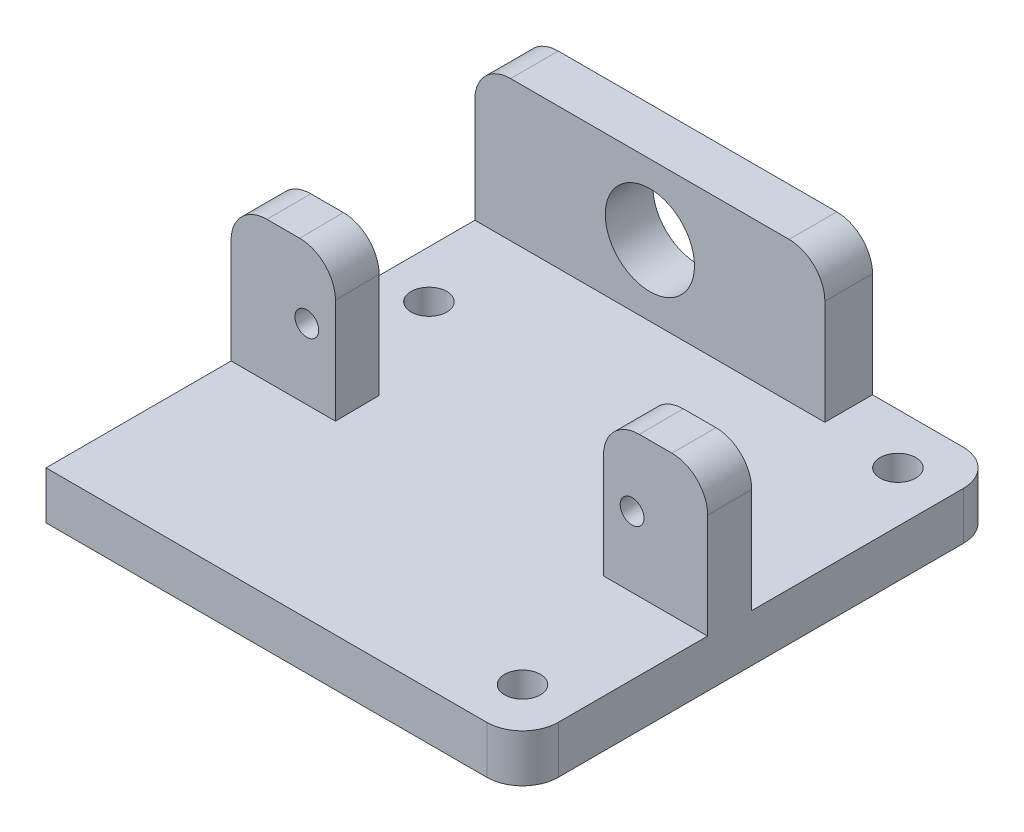
ISO-10303-21;
HEADER;
FILE_DESCRIPTION(('STEP AP214'),'2;1');
FILE_NAME('part.step','',(''),(''),'','','');
FILE_SCHEMA(('AUTOMOTIVE_DESIGN { 1 0 10303 214 1 1 1 1 }'));
ENDSEC;
DATA;
#1=APPLICATION_CONTEXT('core data for automotive mechanical design processes');
#2=APPLICATION_PROTOCOL_DEFINITION('international standard','automotive_design',2000,#1);
#3=PRODUCT_CONTEXT('',#1,'mechanical');
#4=PRODUCT('Part','Part','',(#3));
#5=PRODUCT_RELATED_PRODUCT_CATEGORY('part','',(#4));
#6=PRODUCT_DEFINITION_FORMATION('','',#4);
#7=PRODUCT_DEFINITION_CONTEXT('part definition',#1,'design');
#8=PRODUCT_DEFINITION('design','',#6,#7);
#9=PRODUCT_DEFINITION_SHAPE('','',#8);
#10=(LENGTH_UNIT() NAMED_UNIT(*) SI_UNIT(.MILLI.,.METRE.));
#11=(NAMED_UNIT(*) PLANE_ANGLE_UNIT() SI_UNIT($,.RADIAN.));
#12=(NAMED_UNIT(*) SI_UNIT($,.STERADIAN.) SOLID_ANGLE_UNIT());
#13=UNCERTAINTY_MEASURE_WITH_UNIT(LENGTH_MEASURE(1.E-05),#10,'distance_accuracy_value','');
#14=(GEOMETRIC_REPRESENTATION_CONTEXT(3) GLOBAL_UNCERTAINTY_ASSIGNED_CONTEXT((#13)) GLOBAL_UNIT_ASSIGNED_CONTEXT((#10,
#11,#12)) REPRESENTATION_CONTEXT('',''));
#15=CARTESIAN_POINT('',(0.,0.,0.));
#16=DIRECTION('',(0.,0.,1.));
#17=DIRECTION('',(1.,0.,0.));
#18=AXIS2_PLACEMENT_3D('',#15,#16,#17);
#19=CARTESIAN_POINT('',(0.,4.,0.));
#20=DIRECTION('',(0.,-1.,0.));
#21=DIRECTION('',(0.,0.,-1.));
#22=AXIS2_PLACEMENT_3D('',#19,#20,#21);
#23=PLANE('',#22);
#24=CARTESIAN_POINT('',(15.7573593128807,4.,-15.7573593128807));
#25=DIRECTION('',(0.,1.,0.));
#26=DIRECTION('',(0.,0.,1.));
#27=AXIS2_PLACEMENT_3D('',#24,#25,#26);
#28=CIRCLE('',#27,1.5);
#29=CARTESIAN_POINT('',(15.7573593128807,4.,-14.2573593128807));
#30=VERTEX_POINT('',#29);
#31=EDGE_CURVE('E418',#30,#30,#28,.T.);
#32=ORIENTED_EDGE('',*,*,#31,.F.);
#33=EDGE_LOOP('',(#32));
#34=FACE_BOUND('',#33,.T.);
#35=CARTESIAN_POINT('',(15.7573593128807,4.,15.7573593128807));
#36=DIRECTION('',(0.,1.,0.));
#37=DIRECTION('',(0.,0.,1.));
#38=AXIS2_PLACEMENT_3D('',#35,#36,#37);
#39=CIRCLE('',#38,1.5);
#40=CARTESIAN_POINT('',(15.7573593128807,4.,17.2573593128807));
#41=VERTEX_POINT('',#40);
#42=EDGE_CURVE('E424',#41,#41,#39,.T.);
#43=ORIENTED_EDGE('',*,*,#42,.F.);
#44=EDGE_LOOP('',(#43));
#45=FACE_BOUND('',#44,.T.);
#46=CARTESIAN_POINT('',(-16.,4.,-8.14578966185309));
#47=DIRECTION('',(0.,1.,0.));
#48=DIRECTION('',(0.,0.,1.));
#49=AXIS2_PLACEMENT_3D('',#46,#47,#48);
#50=CIRCLE('',#49,1.5);
#51=CARTESIAN_POINT('',(-16.,4.,-6.64578966185308));
#52=VERTEX_POINT('',#51);
#53=EDGE_CURVE('E415',#52,#52,#50,.T.);
#54=ORIENTED_EDGE('',*,*,#53,.F.);
#55=EDGE_LOOP('',(#54));
#56=FACE_BOUND('',#55,.T.);
#57=DIRECTION('',(0.,0.,-1.));
#58=VECTOR('',#57,1.);
#59=CARTESIAN_POINT('',(20.,4.,20.));
#60=LINE('',#59,#58);
#61=CARTESIAN_POINT('',(20.,4.,0.761716698699549));
#62=VERTEX_POINT('',#61);
#63=CARTESIAN_POINT('',(20.,4.,-17.));
#64=VERTEX_POINT('',#63);
#65=EDGE_CURVE('E280',#62,#64,#60,.T.);
#66=ORIENTED_EDGE('',*,*,#65,.T.);
#67=CARTESIAN_POINT('',(17.,4.,-17.));
#68=DIRECTION('',(0.,-1.,0.));
#69=DIRECTION('',(0.,0.,-1.));
#70=AXIS2_PLACEMENT_3D('',#67,#68,#69);
#71=CIRCLE('',#70,3.);
#72=CARTESIAN_POINT('',(17.,4.,-20.));
#73=VERTEX_POINT('',#72);
#74=EDGE_CURVE('E43',#64,#73,#71,.F.);
#75=ORIENTED_EDGE('',*,*,#74,.T.);
#76=DIRECTION('',(-1.,0.,0.));
#77=VECTOR('',#76,1.);
#78=CARTESIAN_POINT('',(-20.,4.,-20.));
#79=LINE('',#78,#77);
#80=CARTESIAN_POINT('',(9.38,4.,-20.));
#81=VERTEX_POINT('',#80);
#82=EDGE_CURVE('E279',#73,#81,#79,.T.);
#83=ORIENTED_EDGE('',*,*,#82,.T.);
#84=DIRECTION('',(0.,0.,-1.));
#85=VECTOR('',#84,1.);
#86=CARTESIAN_POINT('',(9.38,4.,-16.));
#87=LINE('',#86,#85);
#88=CARTESIAN_POINT('',(9.38,4.,-16.));
#89=VERTEX_POINT('',#88);
#90=EDGE_CURVE('E218',#89,#81,#87,.T.);
#91=ORIENTED_EDGE('',*,*,#90,.F.);
#92=DIRECTION('',(1.,0.,0.));
#93=VECTOR('',#92,1.);
#94=CARTESIAN_POINT('',(9.38,4.,-16.));
#95=LINE('',#94,#93);
#96=CARTESIAN_POINT('',(-20.,4.,-16.));
#97=VERTEX_POINT('',#96);
#98=EDGE_CURVE('E197',#97,#89,#95,.T.);
#99=ORIENTED_EDGE('',*,*,#98,.F.);
#100=DIRECTION('',(0.,0.,1.));
#101=VECTOR('',#100,1.);
#102=CARTESIAN_POINT('',(-20.,4.,20.));
#103=LINE('',#102,#101);
#104=CARTESIAN_POINT('',(-20.,4.,0.761716698699547));
#105=VERTEX_POINT('',#104);
#106=EDGE_CURVE('E206',#97,#105,#103,.T.);
#107=ORIENTED_EDGE('',*,*,#106,.T.);
#108=DIRECTION('',(-1.,0.,0.));
#109=VECTOR('',#108,1.);
#110=CARTESIAN_POINT('',(-20.,4.,0.761716698699547));
#111=LINE('',#110,#109);
#112=CARTESIAN_POINT('',(-11.2760695865092,4.,0.761716698699547));
#113=VERTEX_POINT('',#112);
#114=EDGE_CURVE('E266',#113,#105,#111,.T.);
#115=ORIENTED_EDGE('',*,*,#114,.F.);
#116=DIRECTION('',(-0.00844114842498578,0.,-0.999964372871988));
#117=VECTOR('',#116,1.);
#118=CARTESIAN_POINT('',(-11.2760695865092,4.,0.761716698699547));
#119=LINE('',#118,#117);
#120=CARTESIAN_POINT('',(-11.2448362245817,4.,4.46171669869955));
#121=VERTEX_POINT('',#120);
#122=EDGE_CURVE('E255',#121,#113,#119,.T.);
#123=ORIENTED_EDGE('',*,*,#122,.F.);
#124=DIRECTION('',(1.,0.,0.));
#125=VECTOR('',#124,1.);
#126=CARTESIAN_POINT('',(-20.,4.,4.46171669869955));
#127=LINE('',#126,#125);
#128=CARTESIAN_POINT('',(-20.,4.,4.46171669869955));
#129=VERTEX_POINT('',#128);
#130=EDGE_CURVE('E260',#129,#121,#127,.T.);
#131=ORIENTED_EDGE('',*,*,#130,.F.);
#132=CARTESIAN_POINT('',(-20.,4.,20.));
#133=VERTEX_POINT('',#132);
#134=EDGE_CURVE('E214',#129,#133,#103,.T.);
#135=ORIENTED_EDGE('',*,*,#134,.T.);
#136=DIRECTION('',(1.,0.,0.));
#137=VECTOR('',#136,1.);
#138=CARTESIAN_POINT('',(-20.,4.,20.));
#139=LINE('',#138,#137);
#140=CARTESIAN_POINT('',(17.,4.,20.));
#141=VERTEX_POINT('',#140);
#142=EDGE_CURVE('E213',#133,#141,#139,.T.);
#143=ORIENTED_EDGE('',*,*,#142,.T.);
#144=CARTESIAN_POINT('',(17.,4.,17.));
#145=DIRECTION('',(0.,-1.,0.));
#146=DIRECTION('',(0.,0.,-1.));
#147=AXIS2_PLACEMENT_3D('',#144,#145,#146);
#148=CIRCLE('',#147,3.);
#149=CARTESIAN_POINT('',(20.,4.,17.));
#150=VERTEX_POINT('',#149);
#151=EDGE_CURVE('E360',#141,#150,#148,.F.);
#152=ORIENTED_EDGE('',*,*,#151,.T.);
#153=CARTESIAN_POINT('',(20.,4.,4.46171669869955));
#154=VERTEX_POINT('',#153);
#155=EDGE_CURVE('E277',#150,#154,#60,.T.);
#156=ORIENTED_EDGE('',*,*,#155,.T.);
#157=DIRECTION('',(1.,0.,0.));
#158=VECTOR('',#157,1.);
#159=CARTESIAN_POINT('',(11.2604529055455,4.,4.46171669869955));
#160=LINE('',#159,#158);
#161=CARTESIAN_POINT('',(11.2604529055455,4.,4.46171669869955));
#162=VERTEX_POINT('',#161);
#163=EDGE_CURVE('E236',#162,#154,#160,.T.);
#164=ORIENTED_EDGE('',*,*,#163,.F.);
#165=DIRECTION('',(0.,0.,1.));
#166=VECTOR('',#165,1.);
#167=CARTESIAN_POINT('',(11.2604529055455,4.,0.761716698699549));
#168=LINE('',#167,#166);
#169=CARTESIAN_POINT('',(11.2604529055455,4.,0.761716698699549));
#170=VERTEX_POINT('',#169);
#171=EDGE_CURVE('E242',#170,#162,#168,.T.);
#172=ORIENTED_EDGE('',*,*,#171,.F.);
#173=DIRECTION('',(-1.,0.,0.));
#174=VECTOR('',#173,1.);
#175=CARTESIAN_POINT('',(11.2604529055455,4.,0.761716698699549));
#176=LINE('',#175,#174);
#177=EDGE_CURVE('E231',#62,#170,#176,.T.);
#178=ORIENTED_EDGE('',*,*,#177,.F.);
#179=EDGE_LOOP('',(#66,#75,#83,#91,#99,#107,#115,#123,#131,#135,#143,#152,#156,#164,#172,#178));
#180=FACE_BOUND('',#179,.T.);
#181=ADVANCED_FACE('F35',(#34,#45,#56,#180),#23,.F.);
#182=CARTESIAN_POINT('',(20.,4.,20.));
#183=DIRECTION('',(-1.,0.,0.));
#184=DIRECTION('',(0.,0.,1.));
#185=AXIS2_PLACEMENT_3D('',#182,#183,#184);
#186=PLANE('',#185);
#187=DIRECTION('',(0.,0.,-1.));
#188=VECTOR('',#187,1.);
#189=CARTESIAN_POINT('',(20.,0.,20.));
#190=LINE('',#189,#188);
#191=CARTESIAN_POINT('',(20.,0.,17.));
#192=VERTEX_POINT('',#191);
#193=CARTESIAN_POINT('',(20.,0.,-17.));
#194=VERTEX_POINT('',#193);
#195=EDGE_CURVE('E276',#192,#194,#190,.T.);
#196=ORIENTED_EDGE('',*,*,#195,.T.);
#197=DIRECTION('',(0.,-1.,0.));
#198=VECTOR('',#197,1.);
#199=CARTESIAN_POINT('',(20.,4.,-17.));
#200=LINE('',#199,#198);
#201=EDGE_CURVE('E56',#194,#64,#200,.F.);
#202=ORIENTED_EDGE('',*,*,#201,.T.);
#203=ORIENTED_EDGE('',*,*,#65,.F.);
#204=DIRECTION('',(0.,-1.,0.));
#205=VECTOR('',#204,1.);
#206=CARTESIAN_POINT('',(20.,15.8,0.761716698699549));
#207=LINE('',#206,#205);
#208=CARTESIAN_POINT('',(20.,12.8,0.761716698699549));
#209=VERTEX_POINT('',#208);
#210=EDGE_CURVE('E253',#209,#62,#207,.T.);
#211=ORIENTED_EDGE('',*,*,#210,.F.);
#212=DIRECTION('',(0.,0.,-1.));
#213=VECTOR('',#212,1.);
#214=CARTESIAN_POINT('',(20.,12.8,4.46171669869955));
#215=LINE('',#214,#213);
#216=CARTESIAN_POINT('',(20.,12.8,4.46171669869955));
#217=VERTEX_POINT('',#216);
#218=EDGE_CURVE('E306',#209,#217,#215,.F.);
#219=ORIENTED_EDGE('',*,*,#218,.T.);
#220=DIRECTION('',(0.,-1.,0.));
#221=VECTOR('',#220,1.);
#222=CARTESIAN_POINT('',(20.,15.8,4.46171669869955));
#223=LINE('',#222,#221);
#224=EDGE_CURVE('E239',#217,#154,#223,.T.);
#225=ORIENTED_EDGE('',*,*,#224,.T.);
#226=ORIENTED_EDGE('',*,*,#155,.F.);
#227=DIRECTION('',(0.,-1.,0.));
#228=VECTOR('',#227,1.);
#229=CARTESIAN_POINT('',(20.,4.,17.));
#230=LINE('',#229,#228);
#231=EDGE_CURVE('E356',#150,#192,#230,.T.);
#232=ORIENTED_EDGE('',*,*,#231,.T.);
#233=EDGE_LOOP('',(#196,#202,#203,#211,#219,#225,#226,#232));
#234=FACE_BOUND('',#233,.T.);
#235=ADVANCED_FACE('F375',(#234),#186,.F.);
#236=CARTESIAN_POINT('',(-20.,4.,-20.));
#237=DIRECTION('',(0.,0.,1.));
#238=DIRECTION('',(1.,0.,0.));
#239=AXIS2_PLACEMENT_3D('',#236,#237,#238);
#240=PLANE('',#239);
#241=CARTESIAN_POINT('',(-5.31,9.9,-20.));
#242=DIRECTION('',(0.,0.,1.));
#243=DIRECTION('',(1.,0.,0.));
#244=AXIS2_PLACEMENT_3D('',#241,#242,#243);
#245=CIRCLE('',#244,3.745);
#246=CARTESIAN_POINT('',(-1.565,9.9,-20.));
#247=VERTEX_POINT('',#246);
#248=EDGE_CURVE('E224',#247,#247,#245,.T.);
#249=ORIENTED_EDGE('',*,*,#248,.T.);
#250=EDGE_LOOP('',(#249));
#251=FACE_BOUND('',#250,.T.);
#252=ORIENTED_EDGE('',*,*,#82,.F.);
#253=DIRECTION('',(0.,-1.,0.));
#254=VECTOR('',#253,1.);
#255=CARTESIAN_POINT('',(17.,4.,-20.));
#256=LINE('',#255,#254);
#257=CARTESIAN_POINT('',(17.,0.,-20.));
#258=VERTEX_POINT('',#257);
#259=EDGE_CURVE('E349',#73,#258,#256,.T.);
#260=ORIENTED_EDGE('',*,*,#259,.T.);
#261=DIRECTION('',(-1.,0.,0.));
#262=VECTOR('',#261,1.);
#263=CARTESIAN_POINT('',(-20.,0.,-20.));
#264=LINE('',#263,#262);
#265=CARTESIAN_POINT('',(-20.,0.,-20.));
#266=VERTEX_POINT('',#265);
#267=EDGE_CURVE('E285',#258,#266,#264,.T.);
#268=ORIENTED_EDGE('',*,*,#267,.T.);
#269=DIRECTION('',(0.,-1.,0.));
#270=VECTOR('',#269,1.);
#271=CARTESIAN_POINT('',(-20.,4.,-20.));
#272=LINE('',#271,#270);
#273=CARTESIAN_POINT('',(-20.,12.8,-20.));
#274=VERTEX_POINT('',#273);
#275=EDGE_CURVE('E293',#274,#266,#272,.T.);
#276=ORIENTED_EDGE('',*,*,#275,.F.);
#277=CARTESIAN_POINT('',(-17.,12.8,-20.));
#278=DIRECTION('',(0.,0.,1.));
#279=DIRECTION('',(1.,0.,0.));
#280=AXIS2_PLACEMENT_3D('',#277,#278,#279);
#281=CIRCLE('',#280,3.);
#282=CARTESIAN_POINT('',(-17.,15.8,-20.));
#283=VERTEX_POINT('',#282);
#284=EDGE_CURVE('E320',#274,#283,#281,.F.);
#285=ORIENTED_EDGE('',*,*,#284,.T.);
#286=DIRECTION('',(-1.,0.,0.));
#287=VECTOR('',#286,1.);
#288=CARTESIAN_POINT('',(9.38,15.8,-20.));
#289=LINE('',#288,#287);
#290=CARTESIAN_POINT('',(6.38,15.8,-20.));
#291=VERTEX_POINT('',#290);
#292=EDGE_CURVE('E219',#291,#283,#289,.T.);
#293=ORIENTED_EDGE('',*,*,#292,.F.);
#294=CARTESIAN_POINT('',(6.38,12.8,-20.));
#295=DIRECTION('',(0.,0.,1.));
#296=DIRECTION('',(1.,0.,0.));
#297=AXIS2_PLACEMENT_3D('',#294,#295,#296);
#298=CIRCLE('',#297,3.);
#299=CARTESIAN_POINT('',(9.38,12.8,-20.));
#300=VERTEX_POINT('',#299);
#301=EDGE_CURVE('E322',#291,#300,#298,.F.);
#302=ORIENTED_EDGE('',*,*,#301,.T.);
#303=DIRECTION('',(0.,-1.,0.));
#304=VECTOR('',#303,1.);
#305=CARTESIAN_POINT('',(9.38,15.8,-20.));
#306=LINE('',#305,#304);
#307=EDGE_CURVE('E202',#300,#81,#306,.T.);
#308=ORIENTED_EDGE('',*,*,#307,.T.);
#309=EDGE_LOOP('',(#252,#260,#268,#276,#285,#293,#302,#308));
#310=FACE_BOUND('',#309,.T.);
#311=ADVANCED_FACE('F367',(#251,#310),#240,.F.);
#312=CARTESIAN_POINT('',(-20.,4.,20.));
#313=DIRECTION('',(1.,0.,0.));
#314=DIRECTION('',(0.,0.,-1.));
#315=AXIS2_PLACEMENT_3D('',#312,#313,#314);
#316=PLANE('',#315);
#317=DIRECTION('',(0.,-1.,0.));
#318=VECTOR('',#317,1.);
#319=CARTESIAN_POINT('',(-20.,15.8,-16.));
#320=LINE('',#319,#318);
#321=CARTESIAN_POINT('',(-20.,12.8,-16.));
#322=VERTEX_POINT('',#321);
#323=EDGE_CURVE('E192',#322,#97,#320,.T.);
#324=ORIENTED_EDGE('',*,*,#323,.F.);
#325=DIRECTION('',(0.,0.,1.));
#326=VECTOR('',#325,1.);
#327=CARTESIAN_POINT('',(-20.,12.8,-20.));
#328=LINE('',#327,#326);
#329=EDGE_CURVE('E331',#322,#274,#328,.F.);
#330=ORIENTED_EDGE('',*,*,#329,.T.);
#331=ORIENTED_EDGE('',*,*,#275,.T.);
#332=DIRECTION('',(0.,0.,1.));
#333=VECTOR('',#332,1.);
#334=CARTESIAN_POINT('',(-20.,0.,20.));
#335=LINE('',#334,#333);
#336=CARTESIAN_POINT('',(-20.,0.,20.));
#337=VERTEX_POINT('',#336);
#338=EDGE_CURVE('E287',#266,#337,#335,.T.);
#339=ORIENTED_EDGE('',*,*,#338,.T.);
#340=DIRECTION('',(0.,-1.,0.));
#341=VECTOR('',#340,1.);
#342=CARTESIAN_POINT('',(-20.,4.,20.));
#343=LINE('',#342,#341);
#344=EDGE_CURVE('E283',#133,#337,#343,.T.);
#345=ORIENTED_EDGE('',*,*,#344,.F.);
#346=ORIENTED_EDGE('',*,*,#134,.F.);
#347=DIRECTION('',(0.,-1.,0.));
#348=VECTOR('',#347,1.);
#349=CARTESIAN_POINT('',(-20.,15.8,4.46171669869955));
#350=LINE('',#349,#348);
#351=CARTESIAN_POINT('',(-20.,12.8,4.46171669869955));
#352=VERTEX_POINT('',#351);
#353=EDGE_CURVE('E271',#352,#129,#350,.T.);
#354=ORIENTED_EDGE('',*,*,#353,.F.);
#355=DIRECTION('',(0.,0.,1.));
#356=VECTOR('',#355,1.);
#357=CARTESIAN_POINT('',(-20.,12.8,0.761716698699547));
#358=LINE('',#357,#356);
#359=CARTESIAN_POINT('',(-20.,12.8,0.761716698699547));
#360=VERTEX_POINT('',#359);
#361=EDGE_CURVE('E329',#352,#360,#358,.F.);
#362=ORIENTED_EDGE('',*,*,#361,.T.);
#363=DIRECTION('',(0.,-1.,0.));
#364=VECTOR('',#363,1.);
#365=CARTESIAN_POINT('',(-20.,15.8,0.761716698699547));
#366=LINE('',#365,#364);
#367=EDGE_CURVE('E209',#360,#105,#366,.T.);
#368=ORIENTED_EDGE('',*,*,#367,.T.);
#369=ORIENTED_EDGE('',*,*,#106,.F.);
#370=EDGE_LOOP('',(#324,#330,#331,#339,#345,#346,#354,#362,#368,#369));
#371=FACE_BOUND('',#370,.T.);
#372=ADVANCED_FACE('F207',(#371),#316,.F.);
#373=CARTESIAN_POINT('',(-20.,4.,20.));
#374=DIRECTION('',(0.,0.,-1.));
#375=DIRECTION('',(-1.,0.,0.));
#376=AXIS2_PLACEMENT_3D('',#373,#374,#375);
#377=PLANE('',#376);
#378=DIRECTION('',(1.,0.,0.));
#379=VECTOR('',#378,1.);
#380=CARTESIAN_POINT('',(-20.,0.,20.));
#381=LINE('',#380,#379);
#382=CARTESIAN_POINT('',(17.,0.,20.));
#383=VERTEX_POINT('',#382);
#384=EDGE_CURVE('E289',#337,#383,#381,.T.);
#385=ORIENTED_EDGE('',*,*,#384,.T.);
#386=DIRECTION('',(0.,-1.,0.));
#387=VECTOR('',#386,1.);
#388=CARTESIAN_POINT('',(17.,4.,20.));
#389=LINE('',#388,#387);
#390=EDGE_CURVE('E11',#383,#141,#389,.F.);
#391=ORIENTED_EDGE('',*,*,#390,.T.);
#392=ORIENTED_EDGE('',*,*,#142,.F.);
#393=ORIENTED_EDGE('',*,*,#344,.T.);
#394=EDGE_LOOP('',(#385,#391,#392,#393));
#395=FACE_BOUND('',#394,.T.);
#396=ADVANCED_FACE('F381',(#395),#377,.F.);
#397=CARTESIAN_POINT('',(0.,0.,0.));
#398=DIRECTION('',(0.,-1.,0.));
#399=DIRECTION('',(0.,0.,-1.));
#400=AXIS2_PLACEMENT_3D('',#397,#398,#399);
#401=PLANE('',#400);
#402=CARTESIAN_POINT('',(15.7573593128807,0.,-15.7573593128807));
#403=DIRECTION('',(0.,1.,0.));
#404=DIRECTION('',(0.,0.,1.));
#405=AXIS2_PLACEMENT_3D('',#402,#403,#404);
#406=CIRCLE('',#405,1.5);
#407=CARTESIAN_POINT('',(15.7573593128807,0.,-14.2573593128807));
#408=VERTEX_POINT('',#407);
#409=EDGE_CURVE('E427',#408,#408,#406,.T.);
#410=ORIENTED_EDGE('',*,*,#409,.T.);
#411=EDGE_LOOP('',(#410));
#412=FACE_BOUND('',#411,.T.);
#413=CARTESIAN_POINT('',(15.7573593128807,0.,15.7573593128807));
#414=DIRECTION('',(0.,1.,0.));
#415=DIRECTION('',(0.,0.,1.));
#416=AXIS2_PLACEMENT_3D('',#413,#414,#415);
#417=CIRCLE('',#416,1.5);
#418=CARTESIAN_POINT('',(15.7573593128807,0.,17.2573593128807));
#419=VERTEX_POINT('',#418);
#420=EDGE_CURVE('E421',#419,#419,#417,.T.);
#421=ORIENTED_EDGE('',*,*,#420,.T.);
#422=EDGE_LOOP('',(#421));
#423=FACE_BOUND('',#422,.T.);
#424=CARTESIAN_POINT('',(-16.,0.,-8.14578966185309));
#425=DIRECTION('',(0.,1.,0.));
#426=DIRECTION('',(0.,0.,1.));
#427=AXIS2_PLACEMENT_3D('',#424,#425,#426);
#428=CIRCLE('',#427,1.5);
#429=CARTESIAN_POINT('',(-16.,0.,-6.64578966185308));
#430=VERTEX_POINT('',#429);
#431=EDGE_CURVE('E414',#430,#430,#428,.T.);
#432=ORIENTED_EDGE('',*,*,#431,.T.);
#433=EDGE_LOOP('',(#432));
#434=FACE_BOUND('',#433,.T.);
#435=ORIENTED_EDGE('',*,*,#267,.F.);
#436=CARTESIAN_POINT('',(17.,0.,-17.));
#437=DIRECTION('',(0.,-1.,0.));
#438=DIRECTION('',(0.,0.,-1.));
#439=AXIS2_PLACEMENT_3D('',#436,#437,#438);
#440=CIRCLE('',#439,3.);
#441=EDGE_CURVE('E354',#258,#194,#440,.T.);
#442=ORIENTED_EDGE('',*,*,#441,.T.);
#443=ORIENTED_EDGE('',*,*,#195,.F.);
#444=CARTESIAN_POINT('',(17.,0.,17.));
#445=DIRECTION('',(0.,-1.,0.));
#446=DIRECTION('',(0.,0.,-1.));
#447=AXIS2_PLACEMENT_3D('',#444,#445,#446);
#448=CIRCLE('',#447,3.);
#449=EDGE_CURVE('E352',#192,#383,#448,.T.);
#450=ORIENTED_EDGE('',*,*,#449,.T.);
#451=ORIENTED_EDGE('',*,*,#384,.F.);
#452=ORIENTED_EDGE('',*,*,#338,.F.);
#453=EDGE_LOOP('',(#435,#442,#443,#450,#451,#452));
#454=FACE_BOUND('',#453,.T.);
#455=ADVANCED_FACE('F373',(#412,#423,#434,#454),#401,.T.);
#456=CARTESIAN_POINT('',(-11.2760695865092,15.8,0.761716698699547));
#457=DIRECTION('',(-0.999964372871988,0.,0.00844114842498578));
#458=DIRECTION('',(0.00844114842498578,0.,0.999964372871988));
#459=AXIS2_PLACEMENT_3D('',#456,#457,#458);
#460=PLANE('',#459);
#461=DIRECTION('',(0.,-1.,0.));
#462=VECTOR('',#461,1.);
#463=CARTESIAN_POINT('',(-11.2760695865092,15.8,0.761716698699547));
#464=LINE('',#463,#462);
#465=CARTESIAN_POINT('',(-11.2760695865092,12.8,0.761716698699547));
#466=VERTEX_POINT('',#465);
#467=EDGE_CURVE('E274',#466,#113,#464,.T.);
#468=ORIENTED_EDGE('',*,*,#467,.F.);
#469=DIRECTION('',(-0.00844114842498578,0.,-0.999964372871988));
#470=VECTOR('',#469,1.);
#471=CARTESIAN_POINT('',(-11.2448362245817,12.8,4.46171669869955));
#472=LINE('',#471,#470);
#473=CARTESIAN_POINT('',(-11.2448362245817,12.8,4.46171669869955));
#474=VERTEX_POINT('',#473);
#475=EDGE_CURVE('E347',#466,#474,#472,.F.);
#476=ORIENTED_EDGE('',*,*,#475,.T.);
#477=DIRECTION('',(0.,-1.,0.));
#478=VECTOR('',#477,1.);
#479=CARTESIAN_POINT('',(-11.2448362245817,15.8,4.46171669869955));
#480=LINE('',#479,#478);
#481=EDGE_CURVE('E263',#474,#121,#480,.T.);
#482=ORIENTED_EDGE('',*,*,#481,.T.);
#483=ORIENTED_EDGE('',*,*,#122,.T.);
#484=EDGE_LOOP('',(#468,#476,#482,#483));
#485=FACE_BOUND('',#484,.T.);
#486=ADVANCED_FACE('F503',(#485),#460,.F.);
#487=CARTESIAN_POINT('',(-20.,15.8,0.761716698699547));
#488=DIRECTION('',(0.,0.,1.));
#489=DIRECTION('',(1.,0.,0.));
#490=AXIS2_PLACEMENT_3D('',#487,#488,#489);
#491=PLANE('',#490);
#492=CARTESIAN_POINT('',(-13.6448362245818,9.9,0.761716698699547));
#493=DIRECTION('',(0.,0.,1.));
#494=DIRECTION('',(1.,0.,0.));
#495=AXIS2_PLACEMENT_3D('',#492,#493,#494);
#496=CIRCLE('',#495,1.);
#497=CARTESIAN_POINT('',(-12.6448362245817,9.9,0.761716698699547));
#498=VERTEX_POINT('',#497);
#499=EDGE_CURVE('E400',#498,#498,#496,.F.);
#500=ORIENTED_EDGE('',*,*,#499,.F.);
#501=EDGE_LOOP('',(#500));
#502=FACE_BOUND('',#501,.T.);
#503=ORIENTED_EDGE('',*,*,#367,.F.);
#504=CARTESIAN_POINT('',(-17.,12.8,0.761716698699547));
#505=DIRECTION('',(0.,0.,1.));
#506=DIRECTION('',(1.,0.,0.));
#507=AXIS2_PLACEMENT_3D('',#504,#505,#506);
#508=CIRCLE('',#507,3.);
#509=CARTESIAN_POINT('',(-17.,15.8,0.761716698699547));
#510=VERTEX_POINT('',#509);
#511=EDGE_CURVE('E345',#360,#510,#508,.F.);
#512=ORIENTED_EDGE('',*,*,#511,.T.);
#513=DIRECTION('',(-1.,0.,0.));
#514=VECTOR('',#513,1.);
#515=CARTESIAN_POINT('',(-20.,15.8,0.761716698699547));
#516=LINE('',#515,#514);
#517=CARTESIAN_POINT('',(-14.2761764717012,15.8,0.761716698699547));
#518=VERTEX_POINT('',#517);
#519=EDGE_CURVE('E256',#518,#510,#516,.T.);
#520=ORIENTED_EDGE('',*,*,#519,.F.);
#521=CARTESIAN_POINT('',(-14.2761764717012,12.8,0.761716698699547));
#522=DIRECTION('',(0.,0.,1.));
#523=DIRECTION('',(1.,0.,0.));
#524=AXIS2_PLACEMENT_3D('',#521,#522,#523);
#525=ELLIPSE('',#524,3.00010688519205,3.);
#526=EDGE_CURVE('E343',#518,#466,#525,.F.);
#527=ORIENTED_EDGE('',*,*,#526,.T.);
#528=ORIENTED_EDGE('',*,*,#467,.T.);
#529=ORIENTED_EDGE('',*,*,#114,.T.);
#530=EDGE_LOOP('',(#503,#512,#520,#527,#528,#529));
#531=FACE_BOUND('',#530,.T.);
#532=ADVANCED_FACE('F499',(#502,#531),#491,.F.);
#533=CARTESIAN_POINT('',(-20.,15.8,4.46171669869955));
#534=DIRECTION('',(0.,0.,-1.));
#535=DIRECTION('',(-1.,0.,0.));
#536=AXIS2_PLACEMENT_3D('',#533,#534,#535);
#537=PLANE('',#536);
#538=CARTESIAN_POINT('',(-13.6448362245818,9.9,4.46171669869955));
#539=DIRECTION('',(0.,0.,1.));
#540=DIRECTION('',(1.,0.,0.));
#541=AXIS2_PLACEMENT_3D('',#538,#539,#540);
#542=CIRCLE('',#541,1.);
#543=CARTESIAN_POINT('',(-12.6448362245817,9.9,4.46171669869955));
#544=VERTEX_POINT('',#543);
#545=EDGE_CURVE('E405',#544,#544,#542,.T.);
#546=ORIENTED_EDGE('',*,*,#545,.F.);
#547=EDGE_LOOP('',(#546));
#548=FACE_BOUND('',#547,.T.);
#549=DIRECTION('',(1.,0.,0.));
#550=VECTOR('',#549,1.);
#551=CARTESIAN_POINT('',(-20.,15.8,4.46171669869955));
#552=LINE('',#551,#550);
#553=CARTESIAN_POINT('',(-17.,15.8,4.46171669869955));
#554=VERTEX_POINT('',#553);
#555=CARTESIAN_POINT('',(-14.2449431097738,15.8,4.46171669869955));
#556=VERTEX_POINT('',#555);
#557=EDGE_CURVE('E259',#554,#556,#552,.T.);
#558=ORIENTED_EDGE('',*,*,#557,.F.);
#559=CARTESIAN_POINT('',(-17.,12.8,4.46171669869955));
#560=DIRECTION('',(0.,0.,-1.));
#561=DIRECTION('',(-1.,0.,0.));
#562=AXIS2_PLACEMENT_3D('',#559,#560,#561);
#563=CIRCLE('',#562,3.);
#564=EDGE_CURVE('E341',#554,#352,#563,.F.);
#565=ORIENTED_EDGE('',*,*,#564,.T.);
#566=ORIENTED_EDGE('',*,*,#353,.T.);
#567=ORIENTED_EDGE('',*,*,#130,.T.);
#568=ORIENTED_EDGE('',*,*,#481,.F.);
#569=CARTESIAN_POINT('',(-14.2449431097738,12.8,4.46171669869955));
#570=DIRECTION('',(0.,0.,-1.));
#571=DIRECTION('',(1.,0.,0.));
#572=AXIS2_PLACEMENT_3D('',#569,#570,#571);
#573=ELLIPSE('',#572,3.00010688519205,3.);
#574=EDGE_CURVE('E339',#474,#556,#573,.F.);
#575=ORIENTED_EDGE('',*,*,#574,.T.);
#576=EDGE_LOOP('',(#558,#565,#566,#567,#568,#575));
#577=FACE_BOUND('',#576,.T.);
#578=ADVANCED_FACE('F495',(#548,#577),#537,.F.);
#579=CARTESIAN_POINT('',(0.,15.8,0.));
#580=DIRECTION('',(0.,1.,0.));
#581=DIRECTION('',(0.,0.,1.));
#582=AXIS2_PLACEMENT_3D('',#579,#580,#581);
#583=PLANE('',#582);
#584=ORIENTED_EDGE('',*,*,#519,.T.);
#585=DIRECTION('',(0.,0.,1.));
#586=VECTOR('',#585,1.);
#587=CARTESIAN_POINT('',(-17.,15.8,4.46171669869955));
#588=LINE('',#587,#586);
#589=EDGE_CURVE('E336',#510,#554,#588,.T.);
#590=ORIENTED_EDGE('',*,*,#589,.T.);
#591=ORIENTED_EDGE('',*,*,#557,.T.);
#592=DIRECTION('',(-0.00844114842498578,0.,-0.999964372871988));
#593=VECTOR('',#592,1.);
#594=CARTESIAN_POINT('',(-14.2759627051251,15.8,0.787040143974504));
#595=LINE('',#594,#593);
#596=EDGE_CURVE('E333',#556,#518,#595,.T.);
#597=ORIENTED_EDGE('',*,*,#596,.T.);
#598=EDGE_LOOP('',(#584,#590,#591,#597));
#599=FACE_BOUND('',#598,.T.);
#600=ADVANCED_FACE('F491',(#599),#583,.T.);
#601=CARTESIAN_POINT('',(11.2604529055455,15.8,0.761716698699549));
#602=DIRECTION('',(0.,0.,1.));
#603=DIRECTION('',(1.,0.,0.));
#604=AXIS2_PLACEMENT_3D('',#601,#602,#603);
#605=PLANE('',#604);
#606=CARTESIAN_POINT('',(13.6604529055455,9.9,0.761716698699547));
#607=DIRECTION('',(0.,0.,1.));
#608=DIRECTION('',(1.,0.,0.));
#609=AXIS2_PLACEMENT_3D('',#606,#607,#608);
#610=CIRCLE('',#609,0.999999999999999);
#611=CARTESIAN_POINT('',(14.6604529055455,9.9,0.761716698699547));
#612=VERTEX_POINT('',#611);
#613=EDGE_CURVE('E408',#612,#612,#610,.F.);
#614=ORIENTED_EDGE('',*,*,#613,.F.);
#615=EDGE_LOOP('',(#614));
#616=FACE_BOUND('',#615,.T.);
#617=DIRECTION('',(-1.,0.,0.));
#618=VECTOR('',#617,1.);
#619=CARTESIAN_POINT('',(11.2604529055455,15.8,0.761716698699549));
#620=LINE('',#619,#618);
#621=CARTESIAN_POINT('',(17.,15.8,0.761716698699549));
#622=VERTEX_POINT('',#621);
#623=CARTESIAN_POINT('',(14.2604529055455,15.8,0.761716698699549));
#624=VERTEX_POINT('',#623);
#625=EDGE_CURVE('E232',#622,#624,#620,.T.);
#626=ORIENTED_EDGE('',*,*,#625,.F.);
#627=CARTESIAN_POINT('',(17.,12.8,0.761716698699549));
#628=DIRECTION('',(0.,0.,1.));
#629=DIRECTION('',(1.,0.,0.));
#630=AXIS2_PLACEMENT_3D('',#627,#628,#629);
#631=CIRCLE('',#630,3.);
#632=EDGE_CURVE('E304',#622,#209,#631,.F.);
#633=ORIENTED_EDGE('',*,*,#632,.T.);
#634=ORIENTED_EDGE('',*,*,#210,.T.);
#635=ORIENTED_EDGE('',*,*,#177,.T.);
#636=DIRECTION('',(0.,-1.,0.));
#637=VECTOR('',#636,1.);
#638=CARTESIAN_POINT('',(11.2604529055455,15.8,0.761716698699549));
#639=LINE('',#638,#637);
#640=CARTESIAN_POINT('',(11.2604529055455,12.8,0.761716698699549));
#641=VERTEX_POINT('',#640);
#642=EDGE_CURVE('E251',#641,#170,#639,.T.);
#643=ORIENTED_EDGE('',*,*,#642,.F.);
#644=CARTESIAN_POINT('',(14.2604529055455,12.8,0.761716698699549));
#645=DIRECTION('',(0.,0.,1.));
#646=DIRECTION('',(1.,0.,0.));
#647=AXIS2_PLACEMENT_3D('',#644,#645,#646);
#648=CIRCLE('',#647,3.);
#649=EDGE_CURVE('E302',#641,#624,#648,.F.);
#650=ORIENTED_EDGE('',*,*,#649,.T.);
#651=EDGE_LOOP('',(#626,#633,#634,#635,#643,#650));
#652=FACE_BOUND('',#651,.T.);
#653=ADVANCED_FACE('F487',(#616,#652),#605,.F.);
#654=CARTESIAN_POINT('',(11.2604529055455,15.8,0.761716698699549));
#655=DIRECTION('',(1.,0.,0.));
#656=DIRECTION('',(0.,0.,-1.));
#657=AXIS2_PLACEMENT_3D('',#654,#655,#656);
#658=PLANE('',#657);
#659=DIRECTION('',(0.,-1.,0.));
#660=VECTOR('',#659,1.);
#661=CARTESIAN_POINT('',(11.2604529055455,15.8,4.46171669869955));
#662=LINE('',#661,#660);
#663=CARTESIAN_POINT('',(11.2604529055455,12.8,4.46171669869955));
#664=VERTEX_POINT('',#663);
#665=EDGE_CURVE('E249',#664,#162,#662,.T.);
#666=ORIENTED_EDGE('',*,*,#665,.F.);
#667=DIRECTION('',(0.,0.,1.));
#668=VECTOR('',#667,1.);
#669=CARTESIAN_POINT('',(11.2604529055455,12.8,0.761716698699549));
#670=LINE('',#669,#668);
#671=EDGE_CURVE('E312',#664,#641,#670,.F.);
#672=ORIENTED_EDGE('',*,*,#671,.T.);
#673=ORIENTED_EDGE('',*,*,#642,.T.);
#674=ORIENTED_EDGE('',*,*,#171,.T.);
#675=EDGE_LOOP('',(#666,#672,#673,#674));
#676=FACE_BOUND('',#675,.T.);
#677=ADVANCED_FACE('F483',(#676),#658,.F.);
#678=CARTESIAN_POINT('',(11.2604529055455,15.8,4.46171669869955));
#679=DIRECTION('',(0.,0.,-1.));
#680=DIRECTION('',(-1.,0.,0.));
#681=AXIS2_PLACEMENT_3D('',#678,#679,#680);
#682=PLANE('',#681);
#683=CARTESIAN_POINT('',(13.6604529055455,9.9,4.46171669869955));
#684=DIRECTION('',(0.,0.,1.));
#685=DIRECTION('',(1.,0.,0.));
#686=AXIS2_PLACEMENT_3D('',#683,#684,#685);
#687=CIRCLE('',#686,0.999999999999999);
#688=CARTESIAN_POINT('',(14.6604529055455,9.9,4.46171669869955));
#689=VERTEX_POINT('',#688);
#690=EDGE_CURVE('E411',#689,#689,#687,.T.);
#691=ORIENTED_EDGE('',*,*,#690,.F.);
#692=EDGE_LOOP('',(#691));
#693=FACE_BOUND('',#692,.T.);
#694=ORIENTED_EDGE('',*,*,#224,.F.);
#695=CARTESIAN_POINT('',(17.,12.8,4.46171669869955));
#696=DIRECTION('',(0.,0.,-1.));
#697=DIRECTION('',(-1.,0.,0.));
#698=AXIS2_PLACEMENT_3D('',#695,#696,#697);
#699=CIRCLE('',#698,3.);
#700=CARTESIAN_POINT('',(17.,15.8,4.46171669869955));
#701=VERTEX_POINT('',#700);
#702=EDGE_CURVE('E310',#217,#701,#699,.F.);
#703=ORIENTED_EDGE('',*,*,#702,.T.);
#704=DIRECTION('',(1.,0.,0.));
#705=VECTOR('',#704,1.);
#706=CARTESIAN_POINT('',(11.2604529055455,15.8,4.46171669869955));
#707=LINE('',#706,#705);
#708=CARTESIAN_POINT('',(14.2604529055455,15.8,4.46171669869955));
#709=VERTEX_POINT('',#708);
#710=EDGE_CURVE('E235',#709,#701,#707,.T.);
#711=ORIENTED_EDGE('',*,*,#710,.F.);
#712=CARTESIAN_POINT('',(14.2604529055455,12.8,4.46171669869955));
#713=DIRECTION('',(0.,0.,-1.));
#714=DIRECTION('',(-1.,0.,0.));
#715=AXIS2_PLACEMENT_3D('',#712,#713,#714);
#716=CIRCLE('',#715,3.);
#717=EDGE_CURVE('E308',#709,#664,#716,.F.);
#718=ORIENTED_EDGE('',*,*,#717,.T.);
#719=ORIENTED_EDGE('',*,*,#665,.T.);
#720=ORIENTED_EDGE('',*,*,#163,.T.);
#721=EDGE_LOOP('',(#694,#703,#711,#718,#719,#720));
#722=FACE_BOUND('',#721,.T.);
#723=ADVANCED_FACE('F479',(#693,#722),#682,.F.);
#724=CARTESIAN_POINT('',(0.,15.8,0.));
#725=DIRECTION('',(0.,1.,0.));
#726=DIRECTION('',(0.,0.,1.));
#727=AXIS2_PLACEMENT_3D('',#724,#725,#726);
#728=PLANE('',#727);
#729=ORIENTED_EDGE('',*,*,#710,.T.);
#730=DIRECTION('',(0.,0.,-1.));
#731=VECTOR('',#730,1.);
#732=CARTESIAN_POINT('',(17.,15.8,0.761716698699549));
#733=LINE('',#732,#731);
#734=EDGE_CURVE('E299',#701,#622,#733,.T.);
#735=ORIENTED_EDGE('',*,*,#734,.T.);
#736=ORIENTED_EDGE('',*,*,#625,.T.);
#737=DIRECTION('',(0.,0.,1.));
#738=VECTOR('',#737,1.);
#739=CARTESIAN_POINT('',(14.2604529055455,15.8,4.46171669869955));
#740=LINE('',#739,#738);
#741=EDGE_CURVE('E296',#624,#709,#740,.T.);
#742=ORIENTED_EDGE('',*,*,#741,.T.);
#743=EDGE_LOOP('',(#729,#735,#736,#742));
#744=FACE_BOUND('',#743,.T.);
#745=ADVANCED_FACE('F475',(#744),#728,.T.);
#746=CARTESIAN_POINT('',(9.38,15.8,-16.));
#747=DIRECTION('',(-1.,0.,0.));
#748=DIRECTION('',(0.,0.,1.));
#749=AXIS2_PLACEMENT_3D('',#746,#747,#748);
#750=PLANE('',#749);
#751=ORIENTED_EDGE('',*,*,#307,.F.);
#752=DIRECTION('',(0.,0.,-1.));
#753=VECTOR('',#752,1.);
#754=CARTESIAN_POINT('',(9.38,12.8,-16.));
#755=LINE('',#754,#753);
#756=CARTESIAN_POINT('',(9.38,12.8,-16.));
#757=VERTEX_POINT('',#756);
#758=EDGE_CURVE('E324',#300,#757,#755,.F.);
#759=ORIENTED_EDGE('',*,*,#758,.T.);
#760=DIRECTION('',(0.,-1.,0.));
#761=VECTOR('',#760,1.);
#762=CARTESIAN_POINT('',(9.38,15.8,-16.));
#763=LINE('',#762,#761);
#764=EDGE_CURVE('E203',#757,#89,#763,.T.);
#765=ORIENTED_EDGE('',*,*,#764,.T.);
#766=ORIENTED_EDGE('',*,*,#90,.T.);
#767=EDGE_LOOP('',(#751,#759,#765,#766));
#768=FACE_BOUND('',#767,.T.);
#769=ADVANCED_FACE('F471',(#768),#750,.F.);
#770=CARTESIAN_POINT('',(9.38,15.8,-16.));
#771=DIRECTION('',(0.,0.,-1.));
#772=DIRECTION('',(-1.,0.,0.));
#773=AXIS2_PLACEMENT_3D('',#770,#771,#772);
#774=PLANE('',#773);
#775=CARTESIAN_POINT('',(-5.31,9.9,-16.));
#776=DIRECTION('',(0.,0.,1.));
#777=DIRECTION('',(1.,0.,0.));
#778=AXIS2_PLACEMENT_3D('',#775,#776,#777);
#779=CIRCLE('',#778,3.745);
#780=CARTESIAN_POINT('',(-1.565,9.9,-16.));
#781=VERTEX_POINT('',#780);
#782=EDGE_CURVE('E397',#781,#781,#779,.T.);
#783=ORIENTED_EDGE('',*,*,#782,.F.);
#784=EDGE_LOOP('',(#783));
#785=FACE_BOUND('',#784,.T.);
#786=ORIENTED_EDGE('',*,*,#764,.F.);
#787=CARTESIAN_POINT('',(6.38,12.8,-16.));
#788=DIRECTION('',(0.,0.,-1.));
#789=DIRECTION('',(-1.,0.,0.));
#790=AXIS2_PLACEMENT_3D('',#787,#788,#789);
#791=CIRCLE('',#790,3.);
#792=CARTESIAN_POINT('',(6.38,15.8,-16.));
#793=VERTEX_POINT('',#792);
#794=EDGE_CURVE('E327',#757,#793,#791,.F.);
#795=ORIENTED_EDGE('',*,*,#794,.T.);
#796=DIRECTION('',(1.,0.,0.));
#797=VECTOR('',#796,1.);
#798=CARTESIAN_POINT('',(-5.31,15.8,-16.));
#799=LINE('',#798,#797);
#800=CARTESIAN_POINT('',(-17.,15.8,-16.));
#801=VERTEX_POINT('',#800);
#802=EDGE_CURVE('E222',#801,#793,#799,.T.);
#803=ORIENTED_EDGE('',*,*,#802,.F.);
#804=CARTESIAN_POINT('',(-17.,12.8,-16.));
#805=DIRECTION('',(0.,0.,-1.));
#806=DIRECTION('',(-1.,0.,0.));
#807=AXIS2_PLACEMENT_3D('',#804,#805,#806);
#808=CIRCLE('',#807,3.);
#809=EDGE_CURVE('E199',#801,#322,#808,.F.);
#810=ORIENTED_EDGE('',*,*,#809,.T.);
#811=ORIENTED_EDGE('',*,*,#323,.T.);
#812=ORIENTED_EDGE('',*,*,#98,.T.);
#813=EDGE_LOOP('',(#786,#795,#803,#810,#811,#812));
#814=FACE_BOUND('',#813,.T.);
#815=ADVANCED_FACE('F195',(#785,#814),#774,.F.);
#816=CARTESIAN_POINT('',(0.,15.8,0.));
#817=DIRECTION('',(0.,1.,0.));
#818=DIRECTION('',(0.,0.,1.));
#819=AXIS2_PLACEMENT_3D('',#816,#817,#818);
#820=PLANE('',#819);
#821=ORIENTED_EDGE('',*,*,#802,.T.);
#822=DIRECTION('',(0.,0.,-1.));
#823=VECTOR('',#822,1.);
#824=CARTESIAN_POINT('',(6.38,15.8,-20.));
#825=LINE('',#824,#823);
#826=EDGE_CURVE('E317',#793,#291,#825,.T.);
#827=ORIENTED_EDGE('',*,*,#826,.T.);
#828=ORIENTED_EDGE('',*,*,#292,.T.);
#829=DIRECTION('',(0.,0.,1.));
#830=VECTOR('',#829,1.);
#831=CARTESIAN_POINT('',(-17.,15.8,-16.));
#832=LINE('',#831,#830);
#833=EDGE_CURVE('E314',#283,#801,#832,.T.);
#834=ORIENTED_EDGE('',*,*,#833,.T.);
#835=EDGE_LOOP('',(#821,#827,#828,#834));
#836=FACE_BOUND('',#835,.T.);
#837=ADVANCED_FACE('F393',(#836),#820,.T.);
#838=CARTESIAN_POINT('',(-5.31,9.9,-20.));
#839=DIRECTION('',(0.,0.,1.));
#840=DIRECTION('',(1.,0.,0.));
#841=AXIS2_PLACEMENT_3D('',#838,#839,#840);
#842=CYLINDRICAL_SURFACE('',#841,3.745);
#843=ORIENTED_EDGE('',*,*,#248,.F.);
#844=EDGE_LOOP('',(#843));
#845=FACE_BOUND('',#844,.T.);
#846=ORIENTED_EDGE('',*,*,#782,.T.);
#847=EDGE_LOOP('',(#846));
#848=FACE_BOUND('',#847,.T.);
#849=ADVANCED_FACE('F462',(#845,#848),#842,.F.);
#850=CARTESIAN_POINT('',(-13.6448362245818,9.9,-2.06671042604665));
#851=DIRECTION('',(0.,0.,1.));
#852=DIRECTION('',(1.,0.,0.));
#853=AXIS2_PLACEMENT_3D('',#850,#851,#852);
#854=CYLINDRICAL_SURFACE('',#853,1.);
#855=ORIENTED_EDGE('',*,*,#499,.T.);
#856=EDGE_LOOP('',(#855));
#857=FACE_BOUND('',#856,.T.);
#858=ORIENTED_EDGE('',*,*,#545,.T.);
#859=EDGE_LOOP('',(#858));
#860=FACE_BOUND('',#859,.T.);
#861=ADVANCED_FACE('F454',(#857,#860),#854,.F.);
#862=CARTESIAN_POINT('',(13.6604529055455,9.9,-2.06671042604665));
#863=DIRECTION('',(0.,0.,1.));
#864=DIRECTION('',(1.,0.,0.));
#865=AXIS2_PLACEMENT_3D('',#862,#863,#864);
#866=CYLINDRICAL_SURFACE('',#865,0.999999999999999);
#867=ORIENTED_EDGE('',*,*,#613,.T.);
#868=EDGE_LOOP('',(#867));
#869=FACE_BOUND('',#868,.T.);
#870=ORIENTED_EDGE('',*,*,#690,.T.);
#871=EDGE_LOOP('',(#870));
#872=FACE_BOUND('',#871,.T.);
#873=ADVANCED_FACE('F445',(#869,#872),#866,.F.);
#874=CARTESIAN_POINT('',(-16.,0.,-8.14578966185309));
#875=DIRECTION('',(0.,1.,0.));
#876=DIRECTION('',(0.,0.,1.));
#877=AXIS2_PLACEMENT_3D('',#874,#875,#876);
#878=CYLINDRICAL_SURFACE('',#877,1.5);
#879=ORIENTED_EDGE('',*,*,#431,.F.);
#880=EDGE_LOOP('',(#879));
#881=FACE_BOUND('',#880,.T.);
#882=ORIENTED_EDGE('',*,*,#53,.T.);
#883=EDGE_LOOP('',(#882));
#884=FACE_BOUND('',#883,.T.);
#885=ADVANCED_FACE('F442',(#881,#884),#878,.F.);
#886=CARTESIAN_POINT('',(15.7573593128807,0.,15.7573593128807));
#887=DIRECTION('',(0.,1.,0.));
#888=DIRECTION('',(0.,0.,1.));
#889=AXIS2_PLACEMENT_3D('',#886,#887,#888);
#890=CYLINDRICAL_SURFACE('',#889,1.5);
#891=ORIENTED_EDGE('',*,*,#420,.F.);
#892=EDGE_LOOP('',(#891));
#893=FACE_BOUND('',#892,.T.);
#894=ORIENTED_EDGE('',*,*,#42,.T.);
#895=EDGE_LOOP('',(#894));
#896=FACE_BOUND('',#895,.T.);
#897=ADVANCED_FACE('F444',(#893,#896),#890,.F.);
#898=CARTESIAN_POINT('',(15.7573593128807,0.,-15.7573593128807));
#899=DIRECTION('',(0.,1.,0.));
#900=DIRECTION('',(0.,0.,1.));
#901=AXIS2_PLACEMENT_3D('',#898,#899,#900);
#902=CYLINDRICAL_SURFACE('',#901,1.5);
#903=ORIENTED_EDGE('',*,*,#409,.F.);
#904=EDGE_LOOP('',(#903));
#905=FACE_BOUND('',#904,.T.);
#906=ORIENTED_EDGE('',*,*,#31,.T.);
#907=EDGE_LOOP('',(#906));
#908=FACE_BOUND('',#907,.T.);
#909=ADVANCED_FACE('F433',(#905,#908),#902,.F.);
#910=CARTESIAN_POINT('',(17.,12.8,0.));
#911=DIRECTION('',(0.,0.,1.));
#912=DIRECTION('',(1.,0.,0.));
#913=AXIS2_PLACEMENT_3D('',#910,#911,#912);
#914=CYLINDRICAL_SURFACE('',#913,3.);
#915=ORIENTED_EDGE('',*,*,#702,.F.);
#916=ORIENTED_EDGE('',*,*,#218,.F.);
#917=ORIENTED_EDGE('',*,*,#632,.F.);
#918=ORIENTED_EDGE('',*,*,#734,.F.);
#919=EDGE_LOOP('',(#915,#916,#917,#918));
#920=FACE_BOUND('',#919,.T.);
#921=ADVANCED_FACE('F520',(#920),#914,.T.);
#922=CARTESIAN_POINT('',(14.2604529055455,12.8,0.));
#923=DIRECTION('',(0.,0.,-1.));
#924=DIRECTION('',(-1.,0.,0.));
#925=AXIS2_PLACEMENT_3D('',#922,#923,#924);
#926=CYLINDRICAL_SURFACE('',#925,3.);
#927=ORIENTED_EDGE('',*,*,#649,.F.);
#928=ORIENTED_EDGE('',*,*,#671,.F.);
#929=ORIENTED_EDGE('',*,*,#717,.F.);
#930=ORIENTED_EDGE('',*,*,#741,.F.);
#931=EDGE_LOOP('',(#927,#928,#929,#930));
#932=FACE_BOUND('',#931,.T.);
#933=ADVANCED_FACE('F523',(#932),#926,.T.);
#934=CARTESIAN_POINT('',(6.38,12.8,0.));
#935=DIRECTION('',(0.,0.,1.));
#936=DIRECTION('',(1.,0.,0.));
#937=AXIS2_PLACEMENT_3D('',#934,#935,#936);
#938=CYLINDRICAL_SURFACE('',#937,3.);
#939=ORIENTED_EDGE('',*,*,#794,.F.);
#940=ORIENTED_EDGE('',*,*,#758,.F.);
#941=ORIENTED_EDGE('',*,*,#301,.F.);
#942=ORIENTED_EDGE('',*,*,#826,.F.);
#943=EDGE_LOOP('',(#939,#940,#941,#942));
#944=FACE_BOUND('',#943,.T.);
#945=ADVANCED_FACE('F527',(#944),#938,.T.);
#946=CARTESIAN_POINT('',(-17.,12.8,0.));
#947=DIRECTION('',(0.,0.,-1.));
#948=DIRECTION('',(-1.,0.,0.));
#949=AXIS2_PLACEMENT_3D('',#946,#947,#948);
#950=CYLINDRICAL_SURFACE('',#949,3.);
#951=ORIENTED_EDGE('',*,*,#284,.F.);
#952=ORIENTED_EDGE('',*,*,#329,.F.);
#953=ORIENTED_EDGE('',*,*,#809,.F.);
#954=ORIENTED_EDGE('',*,*,#833,.F.);
#955=EDGE_LOOP('',(#951,#952,#953,#954));
#956=FACE_BOUND('',#955,.T.);
#957=ADVANCED_FACE('F390',(#956),#950,.T.);
#958=CARTESIAN_POINT('',(-17.,12.8,0.));
#959=DIRECTION('',(0.,0.,-1.));
#960=DIRECTION('',(-1.,0.,0.));
#961=AXIS2_PLACEMENT_3D('',#958,#959,#960);
#962=CYLINDRICAL_SURFACE('',#961,3.);
#963=ORIENTED_EDGE('',*,*,#511,.F.);
#964=ORIENTED_EDGE('',*,*,#361,.F.);
#965=ORIENTED_EDGE('',*,*,#564,.F.);
#966=ORIENTED_EDGE('',*,*,#589,.F.);
#967=EDGE_LOOP('',(#963,#964,#965,#966));
#968=FACE_BOUND('',#967,.T.);
#969=ADVANCED_FACE('F534',(#968),#962,.T.);
#970=CARTESIAN_POINT('',(-14.281588786126,12.8,0.120557305798869));
#971=DIRECTION('',(0.00844114842498578,0.,0.999964372871988));
#972=DIRECTION('',(0.999964372871988,0.,-0.00844114842498578));
#973=AXIS2_PLACEMENT_3D('',#970,#971,#972);
#974=CYLINDRICAL_SURFACE('',#973,3.);
#975=ORIENTED_EDGE('',*,*,#574,.F.);
#976=ORIENTED_EDGE('',*,*,#475,.F.);
#977=ORIENTED_EDGE('',*,*,#526,.F.);
#978=ORIENTED_EDGE('',*,*,#596,.F.);
#979=EDGE_LOOP('',(#975,#976,#977,#978));
#980=FACE_BOUND('',#979,.T.);
#981=ADVANCED_FACE('F537',(#980),#974,.T.);
#982=CARTESIAN_POINT('',(17.,4.,-17.));
#983=DIRECTION('',(0.,-1.,0.));
#984=DIRECTION('',(0.,0.,-1.));
#985=AXIS2_PLACEMENT_3D('',#982,#983,#984);
#986=CYLINDRICAL_SURFACE('',#985,3.);
#987=ORIENTED_EDGE('',*,*,#74,.F.);
#988=ORIENTED_EDGE('',*,*,#201,.F.);
#989=ORIENTED_EDGE('',*,*,#441,.F.);
#990=ORIENTED_EDGE('',*,*,#259,.F.);
#991=EDGE_LOOP('',(#987,#988,#989,#990));
#992=FACE_BOUND('',#991,.T.);
#993=ADVANCED_FACE('F370',(#992),#986,.T.);
#994=CARTESIAN_POINT('',(17.,4.,17.));
#995=DIRECTION('',(0.,-1.,0.));
#996=DIRECTION('',(0.,0.,-1.));
#997=AXIS2_PLACEMENT_3D('',#994,#995,#996);
#998=CYLINDRICAL_SURFACE('',#997,3.);
#999=ORIENTED_EDGE('',*,*,#151,.F.);
#1000=ORIENTED_EDGE('',*,*,#390,.F.);
#1001=ORIENTED_EDGE('',*,*,#449,.F.);
#1002=ORIENTED_EDGE('',*,*,#231,.F.);
#1003=EDGE_LOOP('',(#999,#1000,#1001,#1002));
#1004=FACE_BOUND('',#1003,.T.);
#1005=ADVANCED_FACE('F37',(#1004),#998,.T.);
#1006=CLOSED_SHELL('',(#181,#235,#311,#372,#396,#455,#486,#532,#578,#600,#653,#677,#723,#745,
#769,#815,#837,#849,#861,#873,#885,#897,#909,#921,#933,#945,#957,#969,#981,#993,#1005));
#1007=MANIFOLD_SOLID_BREP('B2',#1006);
#1008=ADVANCED_BREP_SHAPE_REPRESENTATION('',(#18,#1007),#14);
#1009=SHAPE_DEFINITION_REPRESENTATION(#9,#1008);
ENDSEC;
END-ISO-10303-21;
